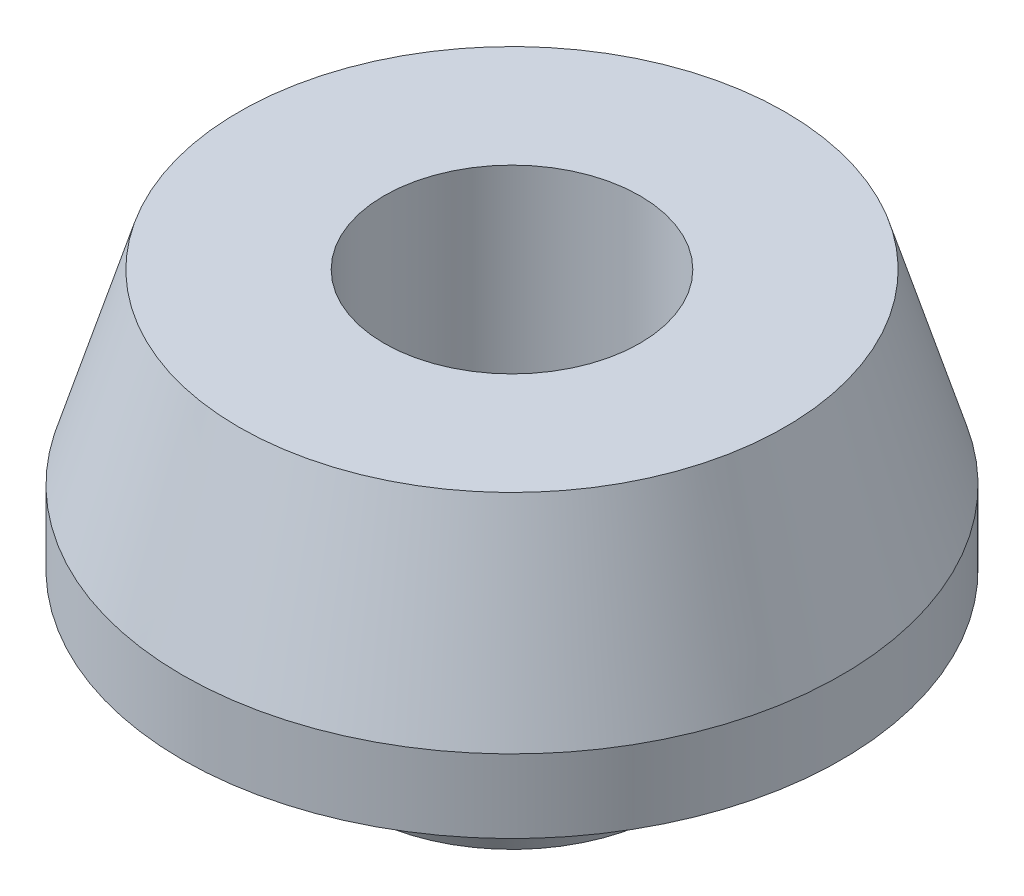
ISO-10303-21;
HEADER;
FILE_DESCRIPTION(('STEP AP214'),'2;1');
FILE_NAME('part.step','',(''),(''),'','','');
FILE_SCHEMA(('AUTOMOTIVE_DESIGN { 1 0 10303 214 1 1 1 1 }'));
ENDSEC;
DATA;
#1=APPLICATION_CONTEXT('core data for automotive mechanical design processes');
#2=APPLICATION_PROTOCOL_DEFINITION('international standard','automotive_design',2000,#1);
#3=PRODUCT_CONTEXT('',#1,'mechanical');
#4=PRODUCT('Part','Part','',(#3));
#5=PRODUCT_RELATED_PRODUCT_CATEGORY('part','',(#4));
#6=PRODUCT_DEFINITION_FORMATION('','',#4);
#7=PRODUCT_DEFINITION_CONTEXT('part definition',#1,'design');
#8=PRODUCT_DEFINITION('design','',#6,#7);
#9=PRODUCT_DEFINITION_SHAPE('','',#8);
#10=(LENGTH_UNIT() NAMED_UNIT(*) SI_UNIT(.MILLI.,.METRE.));
#11=(NAMED_UNIT(*) PLANE_ANGLE_UNIT() SI_UNIT($,.RADIAN.));
#12=(NAMED_UNIT(*) SI_UNIT($,.STERADIAN.) SOLID_ANGLE_UNIT());
#13=UNCERTAINTY_MEASURE_WITH_UNIT(LENGTH_MEASURE(1.E-05),#10,'distance_accuracy_value','');
#14=(GEOMETRIC_REPRESENTATION_CONTEXT(3) GLOBAL_UNCERTAINTY_ASSIGNED_CONTEXT((#13)) GLOBAL_UNIT_ASSIGNED_CONTEXT((#10,
#11,#12)) REPRESENTATION_CONTEXT('',''));
#15=CARTESIAN_POINT('',(0.,0.,0.));
#16=DIRECTION('',(0.,0.,1.));
#17=DIRECTION('',(1.,0.,0.));
#18=AXIS2_PLACEMENT_3D('',#15,#16,#17);
#19=CARTESIAN_POINT('',(0.,0.,0.));
#20=DIRECTION('',(0.,-1.,0.));
#21=DIRECTION('',(0.,0.,-1.));
#22=AXIS2_PLACEMENT_3D('',#19,#20,#21);
#23=CYLINDRICAL_SURFACE('',#22,4.8);
#24=CARTESIAN_POINT('',(0.,0.,0.));
#25=DIRECTION('',(0.,-1.,0.));
#26=DIRECTION('',(0.,0.,-1.));
#27=AXIS2_PLACEMENT_3D('',#24,#25,#26);
#28=CIRCLE('',#27,4.8);
#29=CARTESIAN_POINT('',(0.,0.,-4.8));
#30=VERTEX_POINT('',#29);
#31=EDGE_CURVE('E10',#30,#30,#28,.T.);
#32=ORIENTED_EDGE('',*,*,#31,.T.);
#33=EDGE_LOOP('',(#32));
#34=FACE_BOUND('',#33,.T.);
#35=CARTESIAN_POINT('',(0.,14.75,0.));
#36=DIRECTION('',(0.,-1.,0.));
#37=DIRECTION('',(0.,0.,-1.));
#38=AXIS2_PLACEMENT_3D('',#35,#36,#37);
#39=CIRCLE('',#38,4.8);
#40=CARTESIAN_POINT('',(0.,14.75,-4.8));
#41=VERTEX_POINT('',#40);
#42=EDGE_CURVE('E68',#41,#41,#39,.T.);
#43=ORIENTED_EDGE('',*,*,#42,.F.);
#44=EDGE_LOOP('',(#43));
#45=FACE_BOUND('',#44,.T.);
#46=ADVANCED_FACE('F37',(#34,#45),#23,.F.);
#47=CARTESIAN_POINT('',(4.8,0.,0.));
#48=DIRECTION('',(0.,-1.,0.));
#49=DIRECTION('',(0.,0.,-1.));
#50=AXIS2_PLACEMENT_3D('',#47,#48,#49);
#51=PLANE('',#50);
#52=CARTESIAN_POINT('',(0.,0.,0.));
#53=DIRECTION('',(0.,-1.,0.));
#54=DIRECTION('',(0.,0.,-1.));
#55=AXIS2_PLACEMENT_3D('',#52,#53,#54);
#56=CIRCLE('',#55,5.8);
#57=CARTESIAN_POINT('',(0.,0.,-5.8));
#58=VERTEX_POINT('',#57);
#59=EDGE_CURVE('E44',#58,#58,#56,.T.);
#60=ORIENTED_EDGE('',*,*,#59,.T.);
#61=EDGE_LOOP('',(#60));
#62=FACE_BOUND('',#61,.T.);
#63=ORIENTED_EDGE('',*,*,#31,.F.);
#64=EDGE_LOOP('',(#63));
#65=FACE_BOUND('',#64,.T.);
#66=ADVANCED_FACE('F77',(#62,#65),#51,.T.);
#67=CARTESIAN_POINT('',(0.,0.,0.));
#68=DIRECTION('',(0.,1.,0.));
#69=DIRECTION('',(0.,0.,1.));
#70=AXIS2_PLACEMENT_3D('',#67,#68,#69);
#71=CONICAL_SURFACE('',#70,5.8,0.349065850398863);
#72=CARTESIAN_POINT('',(0.,5.,0.));
#73=DIRECTION('',(0.,-1.,0.));
#74=DIRECTION('',(0.,0.,-1.));
#75=AXIS2_PLACEMENT_3D('',#72,#73,#74);
#76=CIRCLE('',#75,7.61985117133099);
#77=CARTESIAN_POINT('',(0.,5.,-7.61985117133099));
#78=VERTEX_POINT('',#77);
#79=EDGE_CURVE('E49',#78,#78,#76,.T.);
#80=ORIENTED_EDGE('',*,*,#79,.T.);
#81=EDGE_LOOP('',(#80));
#82=FACE_BOUND('',#81,.T.);
#83=ORIENTED_EDGE('',*,*,#59,.F.);
#84=EDGE_LOOP('',(#83));
#85=FACE_BOUND('',#84,.T.);
#86=ADVANCED_FACE('F81',(#82,#85),#71,.T.);
#87=CARTESIAN_POINT('',(7.61985117133099,5.,0.));
#88=DIRECTION('',(0.,-1.,0.));
#89=DIRECTION('',(0.,0.,-1.));
#90=AXIS2_PLACEMENT_3D('',#87,#88,#89);
#91=PLANE('',#90);
#92=CARTESIAN_POINT('',(0.,5.,0.));
#93=DIRECTION('',(0.,-1.,0.));
#94=DIRECTION('',(0.,0.,-1.));
#95=AXIS2_PLACEMENT_3D('',#92,#93,#94);
#96=CIRCLE('',#95,12.369851171331);
#97=CARTESIAN_POINT('',(0.,5.,-12.369851171331));
#98=VERTEX_POINT('',#97);
#99=EDGE_CURVE('E54',#98,#98,#96,.T.);
#100=ORIENTED_EDGE('',*,*,#99,.T.);
#101=EDGE_LOOP('',(#100));
#102=FACE_BOUND('',#101,.T.);
#103=ORIENTED_EDGE('',*,*,#79,.F.);
#104=EDGE_LOOP('',(#103));
#105=FACE_BOUND('',#104,.T.);
#106=ADVANCED_FACE('F85',(#102,#105),#91,.T.);
#107=CARTESIAN_POINT('',(0.,0.,0.));
#108=DIRECTION('',(0.,-1.,0.));
#109=DIRECTION('',(0.,0.,-1.));
#110=AXIS2_PLACEMENT_3D('',#107,#108,#109);
#111=CYLINDRICAL_SURFACE('',#110,12.369851171331);
#112=CARTESIAN_POINT('',(0.,7.75,0.));
#113=DIRECTION('',(0.,-1.,0.));
#114=DIRECTION('',(0.,0.,-1.));
#115=AXIS2_PLACEMENT_3D('',#112,#113,#114);
#116=CIRCLE('',#115,12.369851171331);
#117=CARTESIAN_POINT('',(0.,7.75,-12.369851171331));
#118=VERTEX_POINT('',#117);
#119=EDGE_CURVE('E60',#118,#118,#116,.T.);
#120=ORIENTED_EDGE('',*,*,#119,.T.);
#121=EDGE_LOOP('',(#120));
#122=FACE_BOUND('',#121,.T.);
#123=ORIENTED_EDGE('',*,*,#99,.F.);
#124=EDGE_LOOP('',(#123));
#125=FACE_BOUND('',#124,.T.);
#126=ADVANCED_FACE('F92',(#122,#125),#111,.T.);
#127=CARTESIAN_POINT('',(0.,7.75,0.));
#128=DIRECTION('',(0.,-1.,0.));
#129=DIRECTION('',(0.,0.,-1.));
#130=AXIS2_PLACEMENT_3D('',#127,#128,#129);
#131=CONICAL_SURFACE('',#130,12.369851171331,0.294056485766875);
#132=CARTESIAN_POINT('',(0.,14.75,0.));
#133=DIRECTION('',(0.,-1.,0.));
#134=DIRECTION('',(0.,0.,-1.));
#135=AXIS2_PLACEMENT_3D('',#132,#133,#134);
#136=CIRCLE('',#135,10.25);
#137=CARTESIAN_POINT('',(0.,14.75,-10.25));
#138=VERTEX_POINT('',#137);
#139=EDGE_CURVE('E64',#138,#138,#136,.T.);
#140=ORIENTED_EDGE('',*,*,#139,.T.);
#141=EDGE_LOOP('',(#140));
#142=FACE_BOUND('',#141,.T.);
#143=ORIENTED_EDGE('',*,*,#119,.F.);
#144=EDGE_LOOP('',(#143));
#145=FACE_BOUND('',#144,.T.);
#146=ADVANCED_FACE('F96',(#142,#145),#131,.T.);
#147=CARTESIAN_POINT('',(10.25,14.75,0.));
#148=DIRECTION('',(0.,1.,0.));
#149=DIRECTION('',(0.,0.,1.));
#150=AXIS2_PLACEMENT_3D('',#147,#148,#149);
#151=PLANE('',#150);
#152=ORIENTED_EDGE('',*,*,#42,.T.);
#153=EDGE_LOOP('',(#152));
#154=FACE_BOUND('',#153,.T.);
#155=ORIENTED_EDGE('',*,*,#139,.F.);
#156=EDGE_LOOP('',(#155));
#157=FACE_BOUND('',#156,.T.);
#158=ADVANCED_FACE('F73',(#154,#157),#151,.T.);
#159=CLOSED_SHELL('',(#46,#66,#86,#106,#126,#146,#158));
#160=MANIFOLD_SOLID_BREP('B2',#159);
#161=ADVANCED_BREP_SHAPE_REPRESENTATION('',(#18,#160),#14);
#162=SHAPE_DEFINITION_REPRESENTATION(#9,#161);
ENDSEC;
END-ISO-10303-21;
